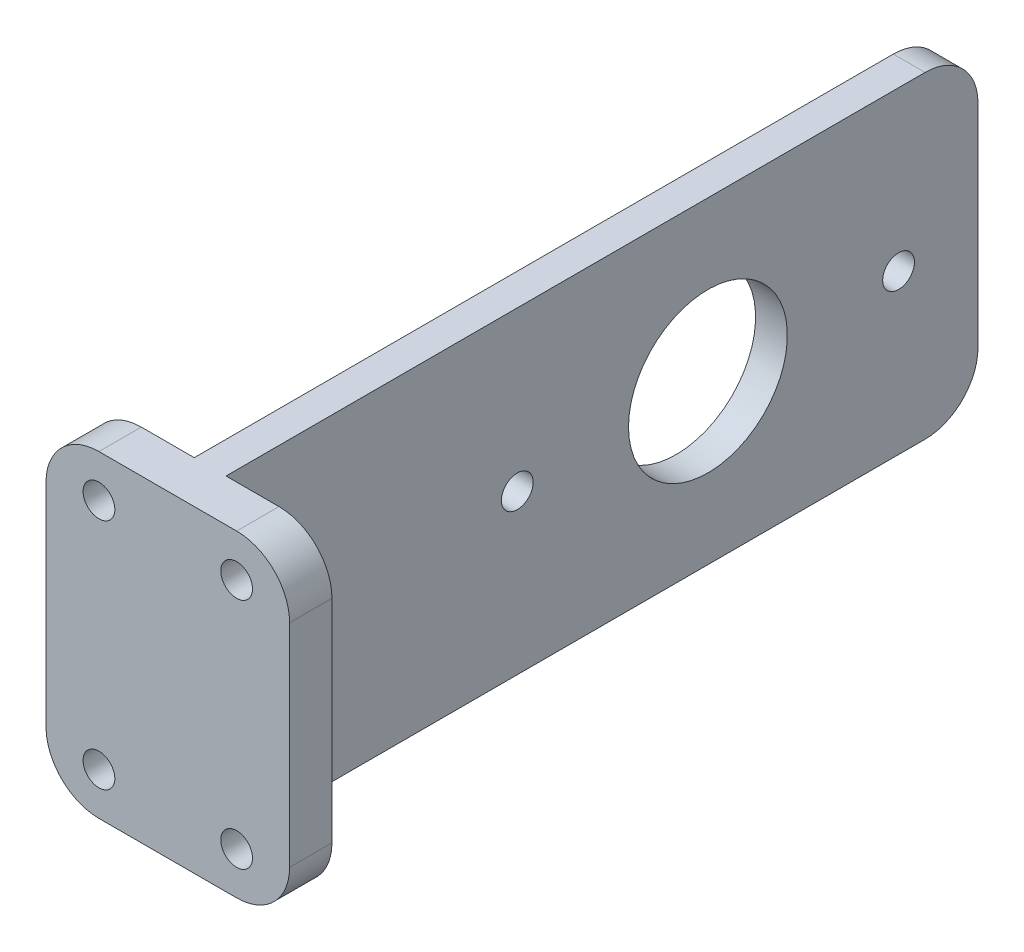
ISO-10303-21;
HEADER;
FILE_DESCRIPTION(('STEP AP214'),'2;1');
FILE_NAME('part.step','',(''),(''),'','','');
FILE_SCHEMA(('AUTOMOTIVE_DESIGN { 1 0 10303 214 1 1 1 1 }'));
ENDSEC;
DATA;
#1=APPLICATION_CONTEXT('core data for automotive mechanical design processes');
#2=APPLICATION_PROTOCOL_DEFINITION('international standard','automotive_design',2000,#1);
#3=PRODUCT_CONTEXT('',#1,'mechanical');
#4=PRODUCT('Part','Part','',(#3));
#5=PRODUCT_RELATED_PRODUCT_CATEGORY('part','',(#4));
#6=PRODUCT_DEFINITION_FORMATION('','',#4);
#7=PRODUCT_DEFINITION_CONTEXT('part definition',#1,'design');
#8=PRODUCT_DEFINITION('design','',#6,#7);
#9=PRODUCT_DEFINITION_SHAPE('','',#8);
#10=(LENGTH_UNIT() NAMED_UNIT(*) SI_UNIT(.MILLI.,.METRE.));
#11=(NAMED_UNIT(*) PLANE_ANGLE_UNIT() SI_UNIT($,.RADIAN.));
#12=(NAMED_UNIT(*) SI_UNIT($,.STERADIAN.) SOLID_ANGLE_UNIT());
#13=UNCERTAINTY_MEASURE_WITH_UNIT(LENGTH_MEASURE(1.E-05),#10,'distance_accuracy_value','');
#14=(GEOMETRIC_REPRESENTATION_CONTEXT(3) GLOBAL_UNCERTAINTY_ASSIGNED_CONTEXT((#13)) GLOBAL_UNIT_ASSIGNED_CONTEXT((#10,
#11,#12)) REPRESENTATION_CONTEXT('',''));
#15=CARTESIAN_POINT('',(0.,0.,0.));
#16=DIRECTION('',(0.,0.,1.));
#17=DIRECTION('',(1.,0.,0.));
#18=AXIS2_PLACEMENT_3D('',#15,#16,#17);
#19=CARTESIAN_POINT('',(-11.5,30.,-4.));
#20=DIRECTION('',(1.,0.,0.));
#21=DIRECTION('',(0.,0.,-1.));
#22=AXIS2_PLACEMENT_3D('',#19,#20,#21);
#23=PLANE('',#22);
#24=DIRECTION('',(0.,-1.,0.));
#25=VECTOR('',#24,1.);
#26=CARTESIAN_POINT('',(-11.5,30.,-4.));
#27=LINE('',#26,#25);
#28=CARTESIAN_POINT('',(-11.5,25.,-4.));
#29=VERTEX_POINT('',#28);
#30=CARTESIAN_POINT('',(-11.5,5.,-4.));
#31=VERTEX_POINT('',#30);
#32=EDGE_CURVE('E169',#29,#31,#27,.T.);
#33=ORIENTED_EDGE('',*,*,#32,.T.);
#34=DIRECTION('',(0.,0.,1.));
#35=VECTOR('',#34,1.);
#36=CARTESIAN_POINT('',(-11.5,5.,-4.));
#37=LINE('',#36,#35);
#38=CARTESIAN_POINT('',(-11.5,5.,0.));
#39=VERTEX_POINT('',#38);
#40=EDGE_CURVE('E215',#31,#39,#37,.T.);
#41=ORIENTED_EDGE('',*,*,#40,.T.);
#42=DIRECTION('',(0.,-1.,0.));
#43=VECTOR('',#42,1.);
#44=CARTESIAN_POINT('',(-11.5,30.,0.));
#45=LINE('',#44,#43);
#46=CARTESIAN_POINT('',(-11.5,25.,0.));
#47=VERTEX_POINT('',#46);
#48=EDGE_CURVE('E196',#47,#39,#45,.T.);
#49=ORIENTED_EDGE('',*,*,#48,.F.);
#50=DIRECTION('',(0.,0.,1.));
#51=VECTOR('',#50,1.);
#52=CARTESIAN_POINT('',(-11.5,25.,-4.));
#53=LINE('',#52,#51);
#54=EDGE_CURVE('E199',#47,#29,#53,.F.);
#55=ORIENTED_EDGE('',*,*,#54,.T.);
#56=EDGE_LOOP('',(#33,#41,#49,#55));
#57=FACE_BOUND('',#56,.T.);
#58=ADVANCED_FACE('F35',(#57),#23,.F.);
#59=CARTESIAN_POINT('',(-11.5,30.,0.));
#60=DIRECTION('',(0.,0.,-1.));
#61=DIRECTION('',(-1.,0.,0.));
#62=AXIS2_PLACEMENT_3D('',#59,#60,#61);
#63=PLANE('',#62);
#64=CARTESIAN_POINT('',(6.5,26.,0.));
#65=DIRECTION('',(0.,0.,1.));
#66=DIRECTION('',(1.,0.,0.));
#67=AXIS2_PLACEMENT_3D('',#64,#65,#66);
#68=CIRCLE('',#67,1.5);
#69=CARTESIAN_POINT('',(8.,26.,0.));
#70=VERTEX_POINT('',#69);
#71=EDGE_CURVE('E304',#70,#70,#68,.T.);
#72=ORIENTED_EDGE('',*,*,#71,.F.);
#73=EDGE_LOOP('',(#72));
#74=FACE_BOUND('',#73,.T.);
#75=CARTESIAN_POINT('',(6.5,4.,0.));
#76=DIRECTION('',(0.,0.,1.));
#77=DIRECTION('',(1.,0.,0.));
#78=AXIS2_PLACEMENT_3D('',#75,#76,#77);
#79=CIRCLE('',#78,1.5);
#80=CARTESIAN_POINT('',(8.,4.,0.));
#81=VERTEX_POINT('',#80);
#82=EDGE_CURVE('E307',#81,#81,#79,.T.);
#83=ORIENTED_EDGE('',*,*,#82,.F.);
#84=EDGE_LOOP('',(#83));
#85=FACE_BOUND('',#84,.T.);
#86=CARTESIAN_POINT('',(-6.5,4.,0.));
#87=DIRECTION('',(0.,0.,1.));
#88=DIRECTION('',(1.,0.,0.));
#89=AXIS2_PLACEMENT_3D('',#86,#87,#88);
#90=CIRCLE('',#89,1.5);
#91=CARTESIAN_POINT('',(-4.99999999999999,4.,0.));
#92=VERTEX_POINT('',#91);
#93=EDGE_CURVE('E303',#92,#92,#90,.T.);
#94=ORIENTED_EDGE('',*,*,#93,.F.);
#95=EDGE_LOOP('',(#94));
#96=FACE_BOUND('',#95,.T.);
#97=CARTESIAN_POINT('',(-6.5,26.,0.));
#98=DIRECTION('',(0.,0.,1.));
#99=DIRECTION('',(1.,0.,0.));
#100=AXIS2_PLACEMENT_3D('',#97,#98,#99);
#101=CIRCLE('',#100,1.5);
#102=CARTESIAN_POINT('',(-5.,26.,0.));
#103=VERTEX_POINT('',#102);
#104=EDGE_CURVE('E204',#103,#103,#101,.T.);
#105=ORIENTED_EDGE('',*,*,#104,.F.);
#106=EDGE_LOOP('',(#105));
#107=FACE_BOUND('',#106,.T.);
#108=ORIENTED_EDGE('',*,*,#48,.T.);
#109=CARTESIAN_POINT('',(-6.5,5.,0.));
#110=DIRECTION('',(0.,0.,-1.));
#111=DIRECTION('',(-1.,0.,0.));
#112=AXIS2_PLACEMENT_3D('',#109,#110,#111);
#113=CIRCLE('',#112,5.);
#114=CARTESIAN_POINT('',(-6.5,0.,0.));
#115=VERTEX_POINT('',#114);
#116=EDGE_CURVE('E224',#39,#115,#113,.F.);
#117=ORIENTED_EDGE('',*,*,#116,.T.);
#118=DIRECTION('',(1.,0.,0.));
#119=VECTOR('',#118,1.);
#120=CARTESIAN_POINT('',(-11.5,0.,0.));
#121=LINE('',#120,#119);
#122=CARTESIAN_POINT('',(6.5,0.,0.));
#123=VERTEX_POINT('',#122);
#124=EDGE_CURVE('E170',#115,#123,#121,.T.);
#125=ORIENTED_EDGE('',*,*,#124,.T.);
#126=CARTESIAN_POINT('',(6.5,5.,0.));
#127=DIRECTION('',(0.,0.,-1.));
#128=DIRECTION('',(-1.,0.,0.));
#129=AXIS2_PLACEMENT_3D('',#126,#127,#128);
#130=CIRCLE('',#129,5.);
#131=CARTESIAN_POINT('',(11.5,5.,0.));
#132=VERTEX_POINT('',#131);
#133=EDGE_CURVE('E218',#123,#132,#130,.F.);
#134=ORIENTED_EDGE('',*,*,#133,.T.);
#135=DIRECTION('',(0.,-1.,0.));
#136=VECTOR('',#135,1.);
#137=CARTESIAN_POINT('',(11.5,30.,0.));
#138=LINE('',#137,#136);
#139=CARTESIAN_POINT('',(11.5,25.,0.));
#140=VERTEX_POINT('',#139);
#141=EDGE_CURVE('E193',#140,#132,#138,.T.);
#142=ORIENTED_EDGE('',*,*,#141,.F.);
#143=CARTESIAN_POINT('',(6.5,25.,0.));
#144=DIRECTION('',(0.,0.,-1.));
#145=DIRECTION('',(-1.,0.,0.));
#146=AXIS2_PLACEMENT_3D('',#143,#144,#145);
#147=CIRCLE('',#146,5.);
#148=CARTESIAN_POINT('',(6.5,30.,0.));
#149=VERTEX_POINT('',#148);
#150=EDGE_CURVE('E220',#140,#149,#147,.F.);
#151=ORIENTED_EDGE('',*,*,#150,.T.);
#152=DIRECTION('',(1.,0.,0.));
#153=VECTOR('',#152,1.);
#154=CARTESIAN_POINT('',(-11.5,30.,0.));
#155=LINE('',#154,#153);
#156=CARTESIAN_POINT('',(-6.5,30.,0.));
#157=VERTEX_POINT('',#156);
#158=EDGE_CURVE('E149',#157,#149,#155,.T.);
#159=ORIENTED_EDGE('',*,*,#158,.F.);
#160=CARTESIAN_POINT('',(-6.5,25.,0.));
#161=DIRECTION('',(0.,0.,-1.));
#162=DIRECTION('',(-1.,0.,0.));
#163=AXIS2_PLACEMENT_3D('',#160,#161,#162);
#164=CIRCLE('',#163,5.);
#165=EDGE_CURVE('E222',#157,#47,#164,.F.);
#166=ORIENTED_EDGE('',*,*,#165,.T.);
#167=EDGE_LOOP('',(#108,#117,#125,#134,#142,#151,#159,#166));
#168=FACE_BOUND('',#167,.T.);
#169=ADVANCED_FACE('F280',(#74,#85,#96,#107,#168),#63,.F.);
#170=CARTESIAN_POINT('',(11.5,30.,-4.));
#171=DIRECTION('',(-1.,0.,0.));
#172=DIRECTION('',(0.,0.,1.));
#173=AXIS2_PLACEMENT_3D('',#170,#171,#172);
#174=PLANE('',#173);
#175=DIRECTION('',(0.,-1.,0.));
#176=VECTOR('',#175,1.);
#177=CARTESIAN_POINT('',(11.5,30.,-4.));
#178=LINE('',#177,#176);
#179=CARTESIAN_POINT('',(11.5,25.,-4.));
#180=VERTEX_POINT('',#179);
#181=CARTESIAN_POINT('',(11.5,5.,-4.));
#182=VERTEX_POINT('',#181);
#183=EDGE_CURVE('E157',#180,#182,#178,.T.);
#184=ORIENTED_EDGE('',*,*,#183,.F.);
#185=DIRECTION('',(0.,0.,-1.));
#186=VECTOR('',#185,1.);
#187=CARTESIAN_POINT('',(11.5,25.,0.));
#188=LINE('',#187,#186);
#189=EDGE_CURVE('E249',#180,#140,#188,.F.);
#190=ORIENTED_EDGE('',*,*,#189,.T.);
#191=ORIENTED_EDGE('',*,*,#141,.T.);
#192=DIRECTION('',(0.,0.,-1.));
#193=VECTOR('',#192,1.);
#194=CARTESIAN_POINT('',(11.5,5.,-4.));
#195=LINE('',#194,#193);
#196=EDGE_CURVE('E246',#132,#182,#195,.T.);
#197=ORIENTED_EDGE('',*,*,#196,.T.);
#198=EDGE_LOOP('',(#184,#190,#191,#197));
#199=FACE_BOUND('',#198,.T.);
#200=ADVANCED_FACE('F318',(#199),#174,.F.);
#201=CARTESIAN_POINT('',(11.5,30.,-4.));
#202=DIRECTION('',(0.,0.,1.));
#203=DIRECTION('',(1.,0.,0.));
#204=AXIS2_PLACEMENT_3D('',#201,#202,#203);
#205=PLANE('',#204);
#206=CARTESIAN_POINT('',(6.5,26.,-4.));
#207=DIRECTION('',(0.,0.,1.));
#208=DIRECTION('',(1.,0.,0.));
#209=AXIS2_PLACEMENT_3D('',#206,#207,#208);
#210=CIRCLE('',#209,1.5);
#211=CARTESIAN_POINT('',(8.,26.,-4.));
#212=VERTEX_POINT('',#211);
#213=EDGE_CURVE('E210',#212,#212,#210,.T.);
#214=ORIENTED_EDGE('',*,*,#213,.T.);
#215=EDGE_LOOP('',(#214));
#216=FACE_BOUND('',#215,.T.);
#217=CARTESIAN_POINT('',(6.5,4.,-4.));
#218=DIRECTION('',(0.,0.,1.));
#219=DIRECTION('',(1.,0.,0.));
#220=AXIS2_PLACEMENT_3D('',#217,#218,#219);
#221=CIRCLE('',#220,1.5);
#222=CARTESIAN_POINT('',(8.,4.,-4.));
#223=VERTEX_POINT('',#222);
#224=EDGE_CURVE('E207',#223,#223,#221,.T.);
#225=ORIENTED_EDGE('',*,*,#224,.T.);
#226=EDGE_LOOP('',(#225));
#227=FACE_BOUND('',#226,.T.);
#228=DIRECTION('',(-1.,0.,0.));
#229=VECTOR('',#228,1.);
#230=CARTESIAN_POINT('',(11.5,30.,-4.));
#231=LINE('',#230,#229);
#232=CARTESIAN_POINT('',(6.5,30.,-4.));
#233=VERTEX_POINT('',#232);
#234=CARTESIAN_POINT('',(1.5,30.,-4.));
#235=VERTEX_POINT('',#234);
#236=EDGE_CURVE('E137',#233,#235,#231,.T.);
#237=ORIENTED_EDGE('',*,*,#236,.F.);
#238=CARTESIAN_POINT('',(6.5,25.,-4.));
#239=DIRECTION('',(0.,0.,1.));
#240=DIRECTION('',(1.,0.,0.));
#241=AXIS2_PLACEMENT_3D('',#238,#239,#240);
#242=CIRCLE('',#241,5.);
#243=EDGE_CURVE('E244',#233,#180,#242,.F.);
#244=ORIENTED_EDGE('',*,*,#243,.T.);
#245=ORIENTED_EDGE('',*,*,#183,.T.);
#246=CARTESIAN_POINT('',(6.5,5.,-4.));
#247=DIRECTION('',(0.,0.,1.));
#248=DIRECTION('',(1.,0.,0.));
#249=AXIS2_PLACEMENT_3D('',#246,#247,#248);
#250=CIRCLE('',#249,5.);
#251=CARTESIAN_POINT('',(6.5,0.,-4.));
#252=VERTEX_POINT('',#251);
#253=EDGE_CURVE('E242',#182,#252,#250,.F.);
#254=ORIENTED_EDGE('',*,*,#253,.T.);
#255=DIRECTION('',(-1.,0.,0.));
#256=VECTOR('',#255,1.);
#257=CARTESIAN_POINT('',(11.5,0.,-4.));
#258=LINE('',#257,#256);
#259=CARTESIAN_POINT('',(1.5,0.,-4.));
#260=VERTEX_POINT('',#259);
#261=EDGE_CURVE('E155',#252,#260,#258,.T.);
#262=ORIENTED_EDGE('',*,*,#261,.T.);
#263=DIRECTION('',(0.,-1.,0.));
#264=VECTOR('',#263,1.);
#265=CARTESIAN_POINT('',(1.5,30.,-4.));
#266=LINE('',#265,#264);
#267=EDGE_CURVE('E152',#235,#260,#266,.T.);
#268=ORIENTED_EDGE('',*,*,#267,.F.);
#269=EDGE_LOOP('',(#237,#244,#245,#254,#262,#268));
#270=FACE_BOUND('',#269,.T.);
#271=ADVANCED_FACE('F153',(#216,#227,#270),#205,.F.);
#272=CARTESIAN_POINT('',(1.5,30.,-4.));
#273=DIRECTION('',(-1.,0.,0.));
#274=DIRECTION('',(0.,0.,1.));
#275=AXIS2_PLACEMENT_3D('',#272,#273,#274);
#276=PLANE('',#275);
#277=CARTESIAN_POINT('',(1.49999999999999,15.,-67.5));
#278=DIRECTION('',(-1.,0.,0.));
#279=DIRECTION('',(0.,0.,1.));
#280=AXIS2_PLACEMENT_3D('',#277,#278,#279);
#281=CIRCLE('',#280,1.5);
#282=CARTESIAN_POINT('',(1.49999999999999,15.,-66.));
#283=VERTEX_POINT('',#282);
#284=EDGE_CURVE('E173',#283,#283,#281,.T.);
#285=ORIENTED_EDGE('',*,*,#284,.T.);
#286=EDGE_LOOP('',(#285));
#287=FACE_BOUND('',#286,.T.);
#288=CARTESIAN_POINT('',(1.5,15.,-31.5));
#289=DIRECTION('',(-1.,0.,0.));
#290=DIRECTION('',(0.,0.,1.));
#291=AXIS2_PLACEMENT_3D('',#288,#289,#290);
#292=CIRCLE('',#291,1.5);
#293=CARTESIAN_POINT('',(1.5,15.,-30.));
#294=VERTEX_POINT('',#293);
#295=EDGE_CURVE('E287',#294,#294,#292,.T.);
#296=ORIENTED_EDGE('',*,*,#295,.T.);
#297=EDGE_LOOP('',(#296));
#298=FACE_BOUND('',#297,.T.);
#299=CARTESIAN_POINT('',(1.49999999999999,15.,-49.5));
#300=DIRECTION('',(-1.,0.,0.));
#301=DIRECTION('',(0.,0.,1.));
#302=AXIS2_PLACEMENT_3D('',#299,#300,#301);
#303=CIRCLE('',#302,7.5);
#304=CARTESIAN_POINT('',(1.49999999999999,15.,-42.));
#305=VERTEX_POINT('',#304);
#306=EDGE_CURVE('E290',#305,#305,#303,.T.);
#307=ORIENTED_EDGE('',*,*,#306,.T.);
#308=EDGE_LOOP('',(#307));
#309=FACE_BOUND('',#308,.T.);
#310=DIRECTION('',(0.,-1.,0.));
#311=VECTOR('',#310,1.);
#312=CARTESIAN_POINT('',(1.49999999999999,30.,-75.));
#313=LINE('',#312,#311);
#314=CARTESIAN_POINT('',(1.49999999999999,25.,-75.));
#315=VERTEX_POINT('',#314);
#316=CARTESIAN_POINT('',(1.49999999999999,5.,-75.));
#317=VERTEX_POINT('',#316);
#318=EDGE_CURVE('E158',#315,#317,#313,.T.);
#319=ORIENTED_EDGE('',*,*,#318,.F.);
#320=CARTESIAN_POINT('',(1.49999999999999,25.,-70.));
#321=DIRECTION('',(-1.,0.,0.));
#322=DIRECTION('',(0.,0.,1.));
#323=AXIS2_PLACEMENT_3D('',#320,#321,#322);
#324=CIRCLE('',#323,5.);
#325=CARTESIAN_POINT('',(1.49999999999999,30.,-70.));
#326=VERTEX_POINT('',#325);
#327=EDGE_CURVE('E11',#315,#326,#324,.F.);
#328=ORIENTED_EDGE('',*,*,#327,.T.);
#329=DIRECTION('',(0.,0.,-1.));
#330=VECTOR('',#329,1.);
#331=CARTESIAN_POINT('',(1.5,30.,-4.));
#332=LINE('',#331,#330);
#333=EDGE_CURVE('E143',#235,#326,#332,.T.);
#334=ORIENTED_EDGE('',*,*,#333,.F.);
#335=ORIENTED_EDGE('',*,*,#267,.T.);
#336=DIRECTION('',(0.,0.,-1.));
#337=VECTOR('',#336,1.);
#338=CARTESIAN_POINT('',(1.5,0.,-4.));
#339=LINE('',#338,#337);
#340=CARTESIAN_POINT('',(1.49999999999999,0.,-70.));
#341=VERTEX_POINT('',#340);
#342=EDGE_CURVE('E175',#260,#341,#339,.T.);
#343=ORIENTED_EDGE('',*,*,#342,.T.);
#344=CARTESIAN_POINT('',(1.49999999999999,5.,-70.));
#345=DIRECTION('',(-1.,0.,0.));
#346=DIRECTION('',(0.,0.,1.));
#347=AXIS2_PLACEMENT_3D('',#344,#345,#346);
#348=CIRCLE('',#347,5.);
#349=EDGE_CURVE('E43',#341,#317,#348,.F.);
#350=ORIENTED_EDGE('',*,*,#349,.T.);
#351=EDGE_LOOP('',(#319,#328,#334,#335,#343,#350));
#352=FACE_BOUND('',#351,.T.);
#353=ADVANCED_FACE('F160',(#287,#298,#309,#352),#276,.F.);
#354=CARTESIAN_POINT('',(-1.5,30.,-75.));
#355=DIRECTION('',(0.,0.,1.));
#356=DIRECTION('',(1.,0.,0.));
#357=AXIS2_PLACEMENT_3D('',#354,#355,#356);
#358=PLANE('',#357);
#359=DIRECTION('',(0.,-1.,0.));
#360=VECTOR('',#359,1.);
#361=CARTESIAN_POINT('',(-1.5,30.,-75.));
#362=LINE('',#361,#360);
#363=CARTESIAN_POINT('',(-1.5,25.,-75.));
#364=VERTEX_POINT('',#363);
#365=CARTESIAN_POINT('',(-1.5,5.,-75.));
#366=VERTEX_POINT('',#365);
#367=EDGE_CURVE('E187',#364,#366,#362,.T.);
#368=ORIENTED_EDGE('',*,*,#367,.F.);
#369=DIRECTION('',(-1.,0.,0.));
#370=VECTOR('',#369,1.);
#371=CARTESIAN_POINT('',(1.49999999999999,25.,-75.));
#372=LINE('',#371,#370);
#373=EDGE_CURVE('E56',#364,#315,#372,.F.);
#374=ORIENTED_EDGE('',*,*,#373,.T.);
#375=ORIENTED_EDGE('',*,*,#318,.T.);
#376=DIRECTION('',(-1.,0.,0.));
#377=VECTOR('',#376,1.);
#378=CARTESIAN_POINT('',(-1.5,5.,-75.));
#379=LINE('',#378,#377);
#380=EDGE_CURVE('E255',#317,#366,#379,.T.);
#381=ORIENTED_EDGE('',*,*,#380,.T.);
#382=EDGE_LOOP('',(#368,#374,#375,#381));
#383=FACE_BOUND('',#382,.T.);
#384=ADVANCED_FACE('F259',(#383),#358,.F.);
#385=CARTESIAN_POINT('',(-1.5,30.,-4.));
#386=DIRECTION('',(1.,0.,0.));
#387=DIRECTION('',(0.,0.,-1.));
#388=AXIS2_PLACEMENT_3D('',#385,#386,#387);
#389=PLANE('',#388);
#390=CARTESIAN_POINT('',(-1.5,15.,-67.5));
#391=DIRECTION('',(-1.,0.,0.));
#392=DIRECTION('',(0.,0.,1.));
#393=AXIS2_PLACEMENT_3D('',#390,#391,#392);
#394=CIRCLE('',#393,1.5);
#395=CARTESIAN_POINT('',(-1.5,15.,-66.));
#396=VERTEX_POINT('',#395);
#397=EDGE_CURVE('E293',#396,#396,#394,.T.);
#398=ORIENTED_EDGE('',*,*,#397,.F.);
#399=EDGE_LOOP('',(#398));
#400=FACE_BOUND('',#399,.T.);
#401=CARTESIAN_POINT('',(-1.5,15.,-31.5));
#402=DIRECTION('',(-1.,0.,0.));
#403=DIRECTION('',(0.,0.,1.));
#404=AXIS2_PLACEMENT_3D('',#401,#402,#403);
#405=CIRCLE('',#404,1.5);
#406=CARTESIAN_POINT('',(-1.5,15.,-30.));
#407=VERTEX_POINT('',#406);
#408=EDGE_CURVE('E296',#407,#407,#405,.T.);
#409=ORIENTED_EDGE('',*,*,#408,.F.);
#410=EDGE_LOOP('',(#409));
#411=FACE_BOUND('',#410,.T.);
#412=CARTESIAN_POINT('',(-1.5,15.,-49.5));
#413=DIRECTION('',(-1.,0.,0.));
#414=DIRECTION('',(0.,0.,1.));
#415=AXIS2_PLACEMENT_3D('',#412,#413,#414);
#416=CIRCLE('',#415,7.5);
#417=CARTESIAN_POINT('',(-1.5,15.,-42.));
#418=VERTEX_POINT('',#417);
#419=EDGE_CURVE('E213',#418,#418,#416,.T.);
#420=ORIENTED_EDGE('',*,*,#419,.F.);
#421=EDGE_LOOP('',(#420));
#422=FACE_BOUND('',#421,.T.);
#423=DIRECTION('',(0.,0.,1.));
#424=VECTOR('',#423,1.);
#425=CARTESIAN_POINT('',(-1.5,30.,-4.));
#426=LINE('',#425,#424);
#427=CARTESIAN_POINT('',(-1.5,30.,-70.));
#428=VERTEX_POINT('',#427);
#429=CARTESIAN_POINT('',(-1.5,30.,-4.));
#430=VERTEX_POINT('',#429);
#431=EDGE_CURVE('E162',#428,#430,#426,.T.);
#432=ORIENTED_EDGE('',*,*,#431,.F.);
#433=CARTESIAN_POINT('',(-1.5,25.,-70.));
#434=DIRECTION('',(1.,0.,0.));
#435=DIRECTION('',(0.,0.,-1.));
#436=AXIS2_PLACEMENT_3D('',#433,#434,#435);
#437=CIRCLE('',#436,5.);
#438=EDGE_CURVE('E253',#428,#364,#437,.F.);
#439=ORIENTED_EDGE('',*,*,#438,.T.);
#440=ORIENTED_EDGE('',*,*,#367,.T.);
#441=CARTESIAN_POINT('',(-1.5,5.,-70.));
#442=DIRECTION('',(1.,0.,0.));
#443=DIRECTION('',(0.,0.,-1.));
#444=AXIS2_PLACEMENT_3D('',#441,#442,#443);
#445=CIRCLE('',#444,5.);
#446=CARTESIAN_POINT('',(-1.5,0.,-70.));
#447=VERTEX_POINT('',#446);
#448=EDGE_CURVE('E251',#366,#447,#445,.F.);
#449=ORIENTED_EDGE('',*,*,#448,.T.);
#450=DIRECTION('',(0.,0.,1.));
#451=VECTOR('',#450,1.);
#452=CARTESIAN_POINT('',(-1.5,0.,-4.));
#453=LINE('',#452,#451);
#454=CARTESIAN_POINT('',(-1.5,0.,-4.));
#455=VERTEX_POINT('',#454);
#456=EDGE_CURVE('E177',#447,#455,#453,.T.);
#457=ORIENTED_EDGE('',*,*,#456,.T.);
#458=DIRECTION('',(0.,-1.,0.));
#459=VECTOR('',#458,1.);
#460=CARTESIAN_POINT('',(-1.5,30.,-4.));
#461=LINE('',#460,#459);
#462=EDGE_CURVE('E184',#430,#455,#461,.T.);
#463=ORIENTED_EDGE('',*,*,#462,.F.);
#464=EDGE_LOOP('',(#432,#439,#440,#449,#457,#463));
#465=FACE_BOUND('',#464,.T.);
#466=ADVANCED_FACE('F263',(#400,#411,#422,#465),#389,.F.);
#467=CARTESIAN_POINT('',(-11.5,30.,-4.));
#468=DIRECTION('',(0.,0.,1.));
#469=DIRECTION('',(1.,0.,0.));
#470=AXIS2_PLACEMENT_3D('',#467,#468,#469);
#471=PLANE('',#470);
#472=CARTESIAN_POINT('',(-6.5,4.,-4.));
#473=DIRECTION('',(0.,0.,1.));
#474=DIRECTION('',(1.,0.,0.));
#475=AXIS2_PLACEMENT_3D('',#472,#473,#474);
#476=CIRCLE('',#475,1.5);
#477=CARTESIAN_POINT('',(-4.99999999999999,4.,-4.));
#478=VERTEX_POINT('',#477);
#479=EDGE_CURVE('E203',#478,#478,#476,.T.);
#480=ORIENTED_EDGE('',*,*,#479,.T.);
#481=EDGE_LOOP('',(#480));
#482=FACE_BOUND('',#481,.T.);
#483=CARTESIAN_POINT('',(-6.5,26.,-4.));
#484=DIRECTION('',(0.,0.,1.));
#485=DIRECTION('',(1.,0.,0.));
#486=AXIS2_PLACEMENT_3D('',#483,#484,#485);
#487=CIRCLE('',#486,1.5);
#488=CARTESIAN_POINT('',(-5.,26.,-4.));
#489=VERTEX_POINT('',#488);
#490=EDGE_CURVE('E200',#489,#489,#487,.T.);
#491=ORIENTED_EDGE('',*,*,#490,.T.);
#492=EDGE_LOOP('',(#491));
#493=FACE_BOUND('',#492,.T.);
#494=DIRECTION('',(-1.,0.,0.));
#495=VECTOR('',#494,1.);
#496=CARTESIAN_POINT('',(-11.5,0.,-4.));
#497=LINE('',#496,#495);
#498=CARTESIAN_POINT('',(-6.5,0.,-4.));
#499=VERTEX_POINT('',#498);
#500=EDGE_CURVE('E179',#455,#499,#497,.T.);
#501=ORIENTED_EDGE('',*,*,#500,.T.);
#502=CARTESIAN_POINT('',(-6.5,5.,-4.));
#503=DIRECTION('',(0.,0.,1.));
#504=DIRECTION('',(1.,0.,0.));
#505=AXIS2_PLACEMENT_3D('',#502,#503,#504);
#506=CIRCLE('',#505,5.);
#507=EDGE_CURVE('E234',#499,#31,#506,.F.);
#508=ORIENTED_EDGE('',*,*,#507,.T.);
#509=ORIENTED_EDGE('',*,*,#32,.F.);
#510=CARTESIAN_POINT('',(-6.5,25.,-4.));
#511=DIRECTION('',(0.,0.,1.));
#512=DIRECTION('',(1.,0.,0.));
#513=AXIS2_PLACEMENT_3D('',#510,#511,#512);
#514=CIRCLE('',#513,5.);
#515=CARTESIAN_POINT('',(-6.5,30.,-4.));
#516=VERTEX_POINT('',#515);
#517=EDGE_CURVE('E232',#29,#516,#514,.F.);
#518=ORIENTED_EDGE('',*,*,#517,.T.);
#519=DIRECTION('',(-1.,0.,0.));
#520=VECTOR('',#519,1.);
#521=CARTESIAN_POINT('',(-11.5,30.,-4.));
#522=LINE('',#521,#520);
#523=EDGE_CURVE('E164',#430,#516,#522,.T.);
#524=ORIENTED_EDGE('',*,*,#523,.F.);
#525=ORIENTED_EDGE('',*,*,#462,.T.);
#526=EDGE_LOOP('',(#501,#508,#509,#518,#524,#525));
#527=FACE_BOUND('',#526,.T.);
#528=ADVANCED_FACE('F272',(#482,#493,#527),#471,.F.);
#529=CARTESIAN_POINT('',(0.,30.,0.));
#530=DIRECTION('',(0.,1.,0.));
#531=DIRECTION('',(0.,0.,1.));
#532=AXIS2_PLACEMENT_3D('',#529,#530,#531);
#533=PLANE('',#532);
#534=ORIENTED_EDGE('',*,*,#523,.T.);
#535=DIRECTION('',(0.,0.,1.));
#536=VECTOR('',#535,1.);
#537=CARTESIAN_POINT('',(-6.5,30.,0.));
#538=LINE('',#537,#536);
#539=EDGE_CURVE('E239',#516,#157,#538,.T.);
#540=ORIENTED_EDGE('',*,*,#539,.T.);
#541=ORIENTED_EDGE('',*,*,#158,.T.);
#542=DIRECTION('',(0.,0.,-1.));
#543=VECTOR('',#542,1.);
#544=CARTESIAN_POINT('',(6.5,30.,-4.));
#545=LINE('',#544,#543);
#546=EDGE_CURVE('E147',#149,#233,#545,.T.);
#547=ORIENTED_EDGE('',*,*,#546,.T.);
#548=ORIENTED_EDGE('',*,*,#236,.T.);
#549=ORIENTED_EDGE('',*,*,#333,.T.);
#550=DIRECTION('',(-1.,0.,0.));
#551=VECTOR('',#550,1.);
#552=CARTESIAN_POINT('',(-1.5,30.,-70.));
#553=LINE('',#552,#551);
#554=EDGE_CURVE('E236',#326,#428,#553,.T.);
#555=ORIENTED_EDGE('',*,*,#554,.T.);
#556=ORIENTED_EDGE('',*,*,#431,.T.);
#557=EDGE_LOOP('',(#534,#540,#541,#547,#548,#549,#555,#556));
#558=FACE_BOUND('',#557,.T.);
#559=ADVANCED_FACE('F140',(#558),#533,.T.);
#560=CARTESIAN_POINT('',(0.,0.,0.));
#561=DIRECTION('',(0.,1.,0.));
#562=DIRECTION('',(0.,0.,1.));
#563=AXIS2_PLACEMENT_3D('',#560,#561,#562);
#564=PLANE('',#563);
#565=ORIENTED_EDGE('',*,*,#124,.F.);
#566=DIRECTION('',(0.,0.,1.));
#567=VECTOR('',#566,1.);
#568=CARTESIAN_POINT('',(-6.5,0.,0.));
#569=LINE('',#568,#567);
#570=EDGE_CURVE('E230',#115,#499,#569,.F.);
#571=ORIENTED_EDGE('',*,*,#570,.T.);
#572=ORIENTED_EDGE('',*,*,#500,.F.);
#573=ORIENTED_EDGE('',*,*,#456,.F.);
#574=DIRECTION('',(-1.,0.,0.));
#575=VECTOR('',#574,1.);
#576=CARTESIAN_POINT('',(0.,0.,-70.));
#577=LINE('',#576,#575);
#578=EDGE_CURVE('E226',#447,#341,#577,.F.);
#579=ORIENTED_EDGE('',*,*,#578,.T.);
#580=ORIENTED_EDGE('',*,*,#342,.F.);
#581=ORIENTED_EDGE('',*,*,#261,.F.);
#582=DIRECTION('',(0.,0.,-1.));
#583=VECTOR('',#582,1.);
#584=CARTESIAN_POINT('',(6.5,0.,0.));
#585=LINE('',#584,#583);
#586=EDGE_CURVE('E228',#252,#123,#585,.F.);
#587=ORIENTED_EDGE('',*,*,#586,.T.);
#588=EDGE_LOOP('',(#565,#571,#572,#573,#579,#580,#581,#587));
#589=FACE_BOUND('',#588,.T.);
#590=ADVANCED_FACE('F337',(#589),#564,.F.);
#591=CARTESIAN_POINT('',(11.5,15.,-49.5));
#592=DIRECTION('',(-1.,0.,0.));
#593=DIRECTION('',(0.,0.,1.));
#594=AXIS2_PLACEMENT_3D('',#591,#592,#593);
#595=CYLINDRICAL_SURFACE('',#594,7.5);
#596=ORIENTED_EDGE('',*,*,#419,.T.);
#597=EDGE_LOOP('',(#596));
#598=FACE_BOUND('',#597,.T.);
#599=ORIENTED_EDGE('',*,*,#306,.F.);
#600=EDGE_LOOP('',(#599));
#601=FACE_BOUND('',#600,.T.);
#602=ADVANCED_FACE('F420',(#598,#601),#595,.F.);
#603=CARTESIAN_POINT('',(11.5,15.,-31.5));
#604=DIRECTION('',(-1.,0.,0.));
#605=DIRECTION('',(0.,0.,1.));
#606=AXIS2_PLACEMENT_3D('',#603,#604,#605);
#607=CYLINDRICAL_SURFACE('',#606,1.5);
#608=ORIENTED_EDGE('',*,*,#408,.T.);
#609=EDGE_LOOP('',(#608));
#610=FACE_BOUND('',#609,.T.);
#611=ORIENTED_EDGE('',*,*,#295,.F.);
#612=EDGE_LOOP('',(#611));
#613=FACE_BOUND('',#612,.T.);
#614=ADVANCED_FACE('F429',(#610,#613),#607,.F.);
#615=CARTESIAN_POINT('',(11.5,15.,-67.5));
#616=DIRECTION('',(-1.,0.,0.));
#617=DIRECTION('',(0.,0.,1.));
#618=AXIS2_PLACEMENT_3D('',#615,#616,#617);
#619=CYLINDRICAL_SURFACE('',#618,1.5);
#620=ORIENTED_EDGE('',*,*,#397,.T.);
#621=EDGE_LOOP('',(#620));
#622=FACE_BOUND('',#621,.T.);
#623=ORIENTED_EDGE('',*,*,#284,.F.);
#624=EDGE_LOOP('',(#623));
#625=FACE_BOUND('',#624,.T.);
#626=ADVANCED_FACE('F326',(#622,#625),#619,.F.);
#627=CARTESIAN_POINT('',(-6.5,26.,-75.));
#628=DIRECTION('',(0.,0.,1.));
#629=DIRECTION('',(1.,0.,0.));
#630=AXIS2_PLACEMENT_3D('',#627,#628,#629);
#631=CYLINDRICAL_SURFACE('',#630,1.5);
#632=ORIENTED_EDGE('',*,*,#104,.T.);
#633=EDGE_LOOP('',(#632));
#634=FACE_BOUND('',#633,.T.);
#635=ORIENTED_EDGE('',*,*,#490,.F.);
#636=EDGE_LOOP('',(#635));
#637=FACE_BOUND('',#636,.T.);
#638=ADVANCED_FACE('F323',(#634,#637),#631,.F.);
#639=CARTESIAN_POINT('',(-6.5,4.,-75.));
#640=DIRECTION('',(0.,0.,1.));
#641=DIRECTION('',(1.,0.,0.));
#642=AXIS2_PLACEMENT_3D('',#639,#640,#641);
#643=CYLINDRICAL_SURFACE('',#642,1.5);
#644=ORIENTED_EDGE('',*,*,#93,.T.);
#645=EDGE_LOOP('',(#644));
#646=FACE_BOUND('',#645,.T.);
#647=ORIENTED_EDGE('',*,*,#479,.F.);
#648=EDGE_LOOP('',(#647));
#649=FACE_BOUND('',#648,.T.);
#650=ADVANCED_FACE('F313',(#646,#649),#643,.F.);
#651=CARTESIAN_POINT('',(6.5,4.,-75.));
#652=DIRECTION('',(0.,0.,1.));
#653=DIRECTION('',(1.,0.,0.));
#654=AXIS2_PLACEMENT_3D('',#651,#652,#653);
#655=CYLINDRICAL_SURFACE('',#654,1.5);
#656=ORIENTED_EDGE('',*,*,#82,.T.);
#657=EDGE_LOOP('',(#656));
#658=FACE_BOUND('',#657,.T.);
#659=ORIENTED_EDGE('',*,*,#224,.F.);
#660=EDGE_LOOP('',(#659));
#661=FACE_BOUND('',#660,.T.);
#662=ADVANCED_FACE('F454',(#658,#661),#655,.F.);
#663=CARTESIAN_POINT('',(6.5,26.,-75.));
#664=DIRECTION('',(0.,0.,1.));
#665=DIRECTION('',(1.,0.,0.));
#666=AXIS2_PLACEMENT_3D('',#663,#664,#665);
#667=CYLINDRICAL_SURFACE('',#666,1.5);
#668=ORIENTED_EDGE('',*,*,#71,.T.);
#669=EDGE_LOOP('',(#668));
#670=FACE_BOUND('',#669,.T.);
#671=ORIENTED_EDGE('',*,*,#213,.F.);
#672=EDGE_LOOP('',(#671));
#673=FACE_BOUND('',#672,.T.);
#674=ADVANCED_FACE('F353',(#670,#673),#667,.F.);
#675=CARTESIAN_POINT('',(-6.5,5.,-4.));
#676=DIRECTION('',(0.,0.,1.));
#677=DIRECTION('',(1.,0.,0.));
#678=AXIS2_PLACEMENT_3D('',#675,#676,#677);
#679=CYLINDRICAL_SURFACE('',#678,5.);
#680=ORIENTED_EDGE('',*,*,#507,.F.);
#681=ORIENTED_EDGE('',*,*,#570,.F.);
#682=ORIENTED_EDGE('',*,*,#116,.F.);
#683=ORIENTED_EDGE('',*,*,#40,.F.);
#684=EDGE_LOOP('',(#680,#681,#682,#683));
#685=FACE_BOUND('',#684,.T.);
#686=ADVANCED_FACE('F350',(#685),#679,.T.);
#687=CARTESIAN_POINT('',(-6.5,25.,0.));
#688=DIRECTION('',(0.,0.,-1.));
#689=DIRECTION('',(-1.,0.,0.));
#690=AXIS2_PLACEMENT_3D('',#687,#688,#689);
#691=CYLINDRICAL_SURFACE('',#690,5.);
#692=ORIENTED_EDGE('',*,*,#517,.F.);
#693=ORIENTED_EDGE('',*,*,#54,.F.);
#694=ORIENTED_EDGE('',*,*,#165,.F.);
#695=ORIENTED_EDGE('',*,*,#539,.F.);
#696=EDGE_LOOP('',(#692,#693,#694,#695));
#697=FACE_BOUND('',#696,.T.);
#698=ADVANCED_FACE('F277',(#697),#691,.T.);
#699=CARTESIAN_POINT('',(6.5,25.,0.));
#700=DIRECTION('',(0.,0.,1.));
#701=DIRECTION('',(1.,0.,0.));
#702=AXIS2_PLACEMENT_3D('',#699,#700,#701);
#703=CYLINDRICAL_SURFACE('',#702,5.);
#704=ORIENTED_EDGE('',*,*,#150,.F.);
#705=ORIENTED_EDGE('',*,*,#189,.F.);
#706=ORIENTED_EDGE('',*,*,#243,.F.);
#707=ORIENTED_EDGE('',*,*,#546,.F.);
#708=EDGE_LOOP('',(#704,#705,#706,#707));
#709=FACE_BOUND('',#708,.T.);
#710=ADVANCED_FACE('F357',(#709),#703,.T.);
#711=CARTESIAN_POINT('',(6.5,5.,-4.));
#712=DIRECTION('',(0.,0.,-1.));
#713=DIRECTION('',(-1.,0.,0.));
#714=AXIS2_PLACEMENT_3D('',#711,#712,#713);
#715=CYLINDRICAL_SURFACE('',#714,5.);
#716=ORIENTED_EDGE('',*,*,#133,.F.);
#717=ORIENTED_EDGE('',*,*,#586,.F.);
#718=ORIENTED_EDGE('',*,*,#253,.F.);
#719=ORIENTED_EDGE('',*,*,#196,.F.);
#720=EDGE_LOOP('',(#716,#717,#718,#719));
#721=FACE_BOUND('',#720,.T.);
#722=ADVANCED_FACE('F360',(#721),#715,.T.);
#723=CARTESIAN_POINT('',(0.,25.,-70.));
#724=DIRECTION('',(1.,0.,0.));
#725=DIRECTION('',(0.,0.,-1.));
#726=AXIS2_PLACEMENT_3D('',#723,#724,#725);
#727=CYLINDRICAL_SURFACE('',#726,5.);
#728=ORIENTED_EDGE('',*,*,#327,.F.);
#729=ORIENTED_EDGE('',*,*,#373,.F.);
#730=ORIENTED_EDGE('',*,*,#438,.F.);
#731=ORIENTED_EDGE('',*,*,#554,.F.);
#732=EDGE_LOOP('',(#728,#729,#730,#731));
#733=FACE_BOUND('',#732,.T.);
#734=ADVANCED_FACE('F267',(#733),#727,.T.);
#735=CARTESIAN_POINT('',(-1.5,5.,-70.));
#736=DIRECTION('',(-1.,0.,0.));
#737=DIRECTION('',(0.,0.,1.));
#738=AXIS2_PLACEMENT_3D('',#735,#736,#737);
#739=CYLINDRICAL_SURFACE('',#738,5.);
#740=ORIENTED_EDGE('',*,*,#349,.F.);
#741=ORIENTED_EDGE('',*,*,#578,.F.);
#742=ORIENTED_EDGE('',*,*,#448,.F.);
#743=ORIENTED_EDGE('',*,*,#380,.F.);
#744=EDGE_LOOP('',(#740,#741,#742,#743));
#745=FACE_BOUND('',#744,.T.);
#746=ADVANCED_FACE('F37',(#745),#739,.T.);
#747=CLOSED_SHELL('',(#58,#169,#200,#271,#353,#384,#466,#528,#559,#590,#602,#614,#626,#638,#650,
#662,#674,#686,#698,#710,#722,#734,#746));
#748=MANIFOLD_SOLID_BREP('B2',#747);
#749=ADVANCED_BREP_SHAPE_REPRESENTATION('',(#18,#748),#14);
#750=SHAPE_DEFINITION_REPRESENTATION(#9,#749);
ENDSEC;
END-ISO-10303-21;
